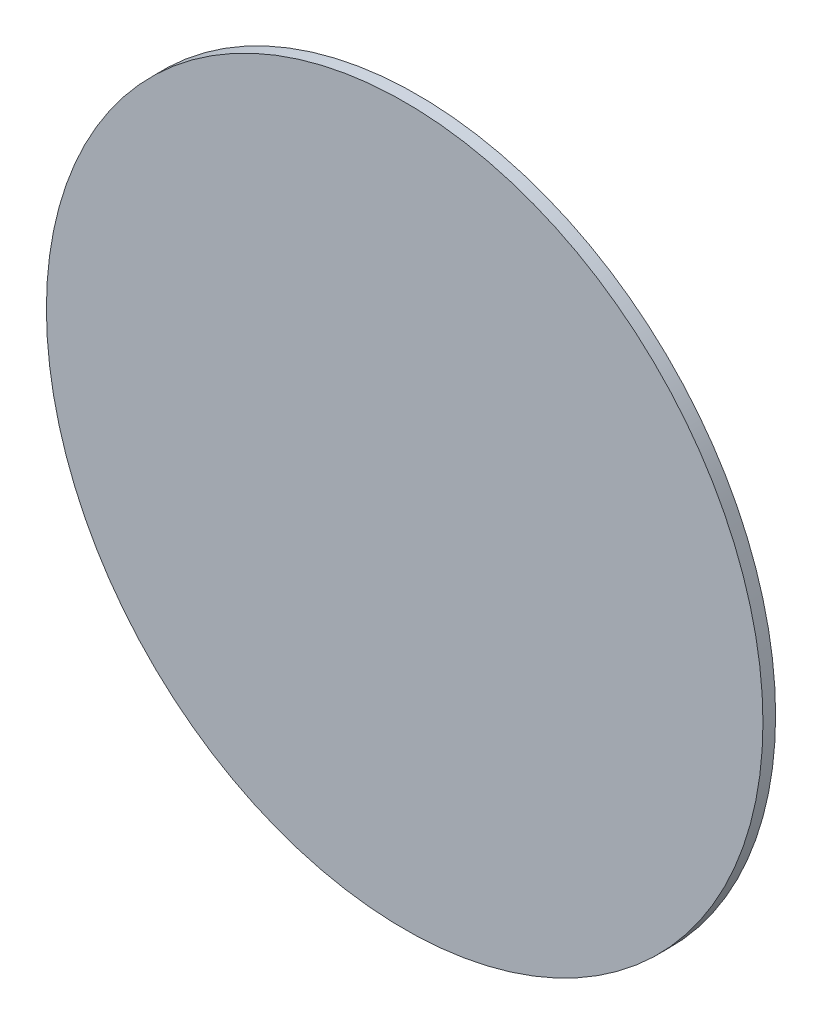
ISO-10303-21;
HEADER;
FILE_DESCRIPTION(('STEP AP214'),'2;1');
FILE_NAME('part.step','',(''),(''),'','','');
FILE_SCHEMA(('AUTOMOTIVE_DESIGN { 1 0 10303 214 1 1 1 1 }'));
ENDSEC;
DATA;
#1=APPLICATION_CONTEXT('core data for automotive mechanical design processes');
#2=APPLICATION_PROTOCOL_DEFINITION('international standard','automotive_design',2000,#1);
#3=PRODUCT_CONTEXT('',#1,'mechanical');
#4=PRODUCT('Part','Part','',(#3));
#5=PRODUCT_RELATED_PRODUCT_CATEGORY('part','',(#4));
#6=PRODUCT_DEFINITION_FORMATION('','',#4);
#7=PRODUCT_DEFINITION_CONTEXT('part definition',#1,'design');
#8=PRODUCT_DEFINITION('design','',#6,#7);
#9=PRODUCT_DEFINITION_SHAPE('','',#8);
#10=(LENGTH_UNIT() NAMED_UNIT(*) SI_UNIT(.MILLI.,.METRE.));
#11=(NAMED_UNIT(*) PLANE_ANGLE_UNIT() SI_UNIT($,.RADIAN.));
#12=(NAMED_UNIT(*) SI_UNIT($,.STERADIAN.) SOLID_ANGLE_UNIT());
#13=UNCERTAINTY_MEASURE_WITH_UNIT(LENGTH_MEASURE(1.E-05),#10,'distance_accuracy_value','');
#14=(GEOMETRIC_REPRESENTATION_CONTEXT(3) GLOBAL_UNCERTAINTY_ASSIGNED_CONTEXT((#13)) GLOBAL_UNIT_ASSIGNED_CONTEXT((#10,
#11,#12)) REPRESENTATION_CONTEXT('',''));
#15=CARTESIAN_POINT('',(0.,0.,0.));
#16=DIRECTION('',(0.,0.,1.));
#17=DIRECTION('',(1.,0.,0.));
#18=AXIS2_PLACEMENT_3D('',#15,#16,#17);
#19=CARTESIAN_POINT('',(0.,0.,3.));
#20=DIRECTION('',(0.,0.,-1.));
#21=DIRECTION('',(-1.,0.,0.));
#22=AXIS2_PLACEMENT_3D('',#19,#20,#21);
#23=CYLINDRICAL_SURFACE('',#22,85.);
#24=CARTESIAN_POINT('',(0.,0.,3.));
#25=DIRECTION('',(0.,0.,1.));
#26=DIRECTION('',(1.,0.,0.));
#27=AXIS2_PLACEMENT_3D('',#24,#25,#26);
#28=CIRCLE('',#27,85.);
#29=CARTESIAN_POINT('',(85.,0.,3.));
#30=VERTEX_POINT('',#29);
#31=EDGE_CURVE('E10',#30,#30,#28,.T.);
#32=ORIENTED_EDGE('',*,*,#31,.F.);
#33=EDGE_LOOP('',(#32));
#34=FACE_BOUND('',#33,.T.);
#35=CARTESIAN_POINT('',(0.,0.,0.));
#36=DIRECTION('',(0.,0.,1.));
#37=DIRECTION('',(1.,0.,0.));
#38=AXIS2_PLACEMENT_3D('',#35,#36,#37);
#39=CIRCLE('',#38,85.);
#40=CARTESIAN_POINT('',(85.,0.,0.));
#41=VERTEX_POINT('',#40);
#42=EDGE_CURVE('E37',#41,#41,#39,.T.);
#43=ORIENTED_EDGE('',*,*,#42,.T.);
#44=EDGE_LOOP('',(#43));
#45=FACE_BOUND('',#44,.T.);
#46=ADVANCED_FACE('F34',(#34,#45),#23,.T.);
#47=CARTESIAN_POINT('',(0.,0.,3.));
#48=DIRECTION('',(0.,0.,1.));
#49=DIRECTION('',(1.,0.,0.));
#50=AXIS2_PLACEMENT_3D('',#47,#48,#49);
#51=PLANE('',#50);
#52=ORIENTED_EDGE('',*,*,#31,.T.);
#53=EDGE_LOOP('',(#52));
#54=FACE_BOUND('',#53,.T.);
#55=ADVANCED_FACE('F51',(#54),#51,.T.);
#56=CARTESIAN_POINT('',(0.,0.,0.));
#57=DIRECTION('',(0.,0.,1.));
#58=DIRECTION('',(1.,0.,0.));
#59=AXIS2_PLACEMENT_3D('',#56,#57,#58);
#60=PLANE('',#59);
#61=ORIENTED_EDGE('',*,*,#42,.F.);
#62=EDGE_LOOP('',(#61));
#63=FACE_BOUND('',#62,.T.);
#64=ADVANCED_FACE('F49',(#63),#60,.F.);
#65=CLOSED_SHELL('',(#46,#55,#64));
#66=MANIFOLD_SOLID_BREP('B2',#65);
#67=ADVANCED_BREP_SHAPE_REPRESENTATION('',(#18,#66),#14);
#68=SHAPE_DEFINITION_REPRESENTATION(#9,#67);
ENDSEC;
END-ISO-10303-21;
